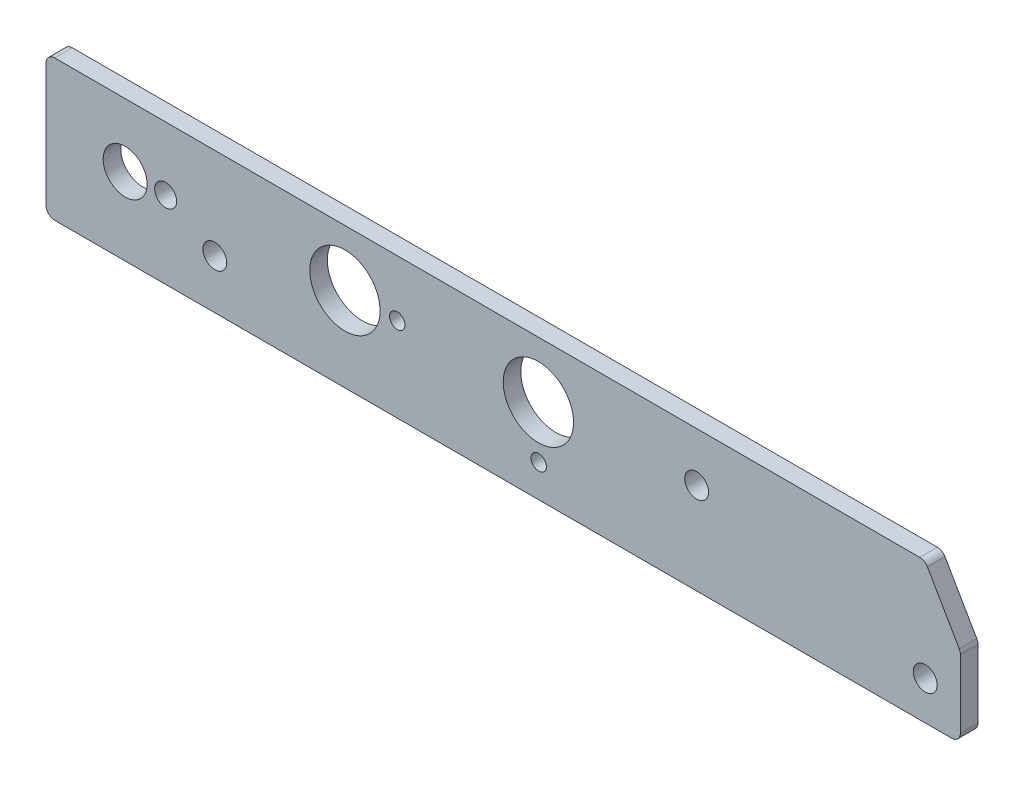
ISO-10303-21;
HEADER;
FILE_DESCRIPTION(('STEP AP214'),'2;1');
FILE_NAME('part.step','',(''),(''),'','','');
FILE_SCHEMA(('AUTOMOTIVE_DESIGN { 1 0 10303 214 1 1 1 1 }'));
ENDSEC;
DATA;
#1=APPLICATION_CONTEXT('core data for automotive mechanical design processes');
#2=APPLICATION_PROTOCOL_DEFINITION('international standard','automotive_design',2000,#1);
#3=PRODUCT_CONTEXT('',#1,'mechanical');
#4=PRODUCT('Part','Part','',(#3));
#5=PRODUCT_RELATED_PRODUCT_CATEGORY('part','',(#4));
#6=PRODUCT_DEFINITION_FORMATION('','',#4);
#7=PRODUCT_DEFINITION_CONTEXT('part definition',#1,'design');
#8=PRODUCT_DEFINITION('design','',#6,#7);
#9=PRODUCT_DEFINITION_SHAPE('','',#8);
#10=(LENGTH_UNIT() NAMED_UNIT(*) SI_UNIT(.MILLI.,.METRE.));
#11=(NAMED_UNIT(*) PLANE_ANGLE_UNIT() SI_UNIT($,.RADIAN.));
#12=(NAMED_UNIT(*) SI_UNIT($,.STERADIAN.) SOLID_ANGLE_UNIT());
#13=UNCERTAINTY_MEASURE_WITH_UNIT(LENGTH_MEASURE(1.E-05),#10,'distance_accuracy_value','');
#14=(GEOMETRIC_REPRESENTATION_CONTEXT(3) GLOBAL_UNCERTAINTY_ASSIGNED_CONTEXT((#13)) GLOBAL_UNIT_ASSIGNED_CONTEXT((#10,
#11,#12)) REPRESENTATION_CONTEXT('',''));
#15=CARTESIAN_POINT('',(0.,0.,0.));
#16=DIRECTION('',(0.,0.,1.));
#17=DIRECTION('',(1.,0.,0.));
#18=AXIS2_PLACEMENT_3D('',#15,#16,#17);
#19=CARTESIAN_POINT('',(157.767651581292,-1.58749999999997,3.175));
#20=DIRECTION('',(0.,0.,1.));
#21=DIRECTION('',(1.,0.,0.));
#22=AXIS2_PLACEMENT_3D('',#19,#20,#21);
#23=PLANE('',#22);
#24=CARTESIAN_POINT('',(158.75,-18.415,3.175));
#25=DIRECTION('',(0.,0.,-1.));
#26=DIRECTION('',(-1.,0.,0.));
#27=AXIS2_PLACEMENT_3D('',#24,#25,#26);
#28=CIRCLE('',#27,2.15265000000001);
#29=CARTESIAN_POINT('',(156.59735,-18.415,3.175));
#30=VERTEX_POINT('',#29);
#31=EDGE_CURVE('E258',#30,#30,#28,.T.);
#32=ORIENTED_EDGE('',*,*,#31,.T.);
#33=EDGE_LOOP('',(#32));
#34=FACE_BOUND('',#33,.T.);
#35=CARTESIAN_POINT('',(117.475,-8.88999999999997,3.175));
#36=DIRECTION('',(0.,0.,-1.));
#37=DIRECTION('',(-1.,0.,0.));
#38=AXIS2_PLACEMENT_3D('',#35,#36,#37);
#39=CIRCLE('',#38,2.15265000000001);
#40=CARTESIAN_POINT('',(115.32235,-8.88999999999997,3.175));
#41=VERTEX_POINT('',#40);
#42=EDGE_CURVE('E252',#41,#41,#39,.T.);
#43=ORIENTED_EDGE('',*,*,#42,.T.);
#44=EDGE_LOOP('',(#43));
#45=FACE_BOUND('',#44,.T.);
#46=CARTESIAN_POINT('',(30.48,-16.51,3.175));
#47=DIRECTION('',(0.,0.,-1.));
#48=DIRECTION('',(-1.,0.,0.));
#49=AXIS2_PLACEMENT_3D('',#46,#47,#48);
#50=CIRCLE('',#49,2.15265);
#51=CARTESIAN_POINT('',(28.32735,-16.51,3.175));
#52=VERTEX_POINT('',#51);
#53=EDGE_CURVE('E246',#52,#52,#50,.T.);
#54=ORIENTED_EDGE('',*,*,#53,.T.);
#55=EDGE_LOOP('',(#54));
#56=FACE_BOUND('',#55,.T.);
#57=CARTESIAN_POINT('',(88.9594715975967,-19.537541196517,3.175));
#58=DIRECTION('',(0.,0.,-1.));
#59=DIRECTION('',(-1.,0.,0.));
#60=AXIS2_PLACEMENT_3D('',#57,#58,#59);
#61=CIRCLE('',#60,1.389126);
#62=CARTESIAN_POINT('',(87.5703455975967,-19.537541196517,3.175));
#63=VERTEX_POINT('',#62);
#64=EDGE_CURVE('E240',#63,#63,#61,.T.);
#65=ORIENTED_EDGE('',*,*,#64,.T.);
#66=EDGE_LOOP('',(#65));
#67=FACE_BOUND('',#66,.T.);
#68=CARTESIAN_POINT('',(63.423407806558,-10.1599999999991,3.175));
#69=DIRECTION('',(0.,0.,-1.));
#70=DIRECTION('',(-1.,0.,0.));
#71=AXIS2_PLACEMENT_3D('',#68,#69,#70);
#72=CIRCLE('',#71,1.389126);
#73=CARTESIAN_POINT('',(62.034281806558,-10.1599999999991,3.175));
#74=VERTEX_POINT('',#73);
#75=EDGE_CURVE('E234',#74,#74,#72,.T.);
#76=ORIENTED_EDGE('',*,*,#75,.T.);
#77=EDGE_LOOP('',(#76));
#78=FACE_BOUND('',#77,.T.);
#79=CARTESIAN_POINT('',(21.598282461873,-11.4299999999998,3.175));
#80=DIRECTION('',(0.,0.,-1.));
#81=DIRECTION('',(-1.,0.,0.));
#82=AXIS2_PLACEMENT_3D('',#79,#80,#81);
#83=CIRCLE('',#82,1.984375);
#84=CARTESIAN_POINT('',(19.613907461873,-11.4299999999998,3.175));
#85=VERTEX_POINT('',#84);
#86=EDGE_CURVE('E228',#85,#85,#83,.T.);
#87=ORIENTED_EDGE('',*,*,#86,.T.);
#88=EDGE_LOOP('',(#87));
#89=FACE_BOUND('',#88,.T.);
#90=CARTESIAN_POINT('',(14.2875000000084,-11.4300000000016,3.175));
#91=DIRECTION('',(0.,0.,-1.));
#92=DIRECTION('',(-1.,0.,0.));
#93=AXIS2_PLACEMENT_3D('',#90,#91,#92);
#94=CIRCLE('',#93,3.96875);
#95=CARTESIAN_POINT('',(10.3187500000084,-11.4300000000016,3.175));
#96=VERTEX_POINT('',#95);
#97=EDGE_CURVE('E222',#96,#96,#94,.T.);
#98=ORIENTED_EDGE('',*,*,#97,.T.);
#99=EDGE_LOOP('',(#98));
#100=FACE_BOUND('',#99,.T.);
#101=CARTESIAN_POINT('',(53.9750000000004,-10.1599999999995,3.175));
#102=DIRECTION('',(0.,0.,-1.));
#103=DIRECTION('',(-1.,0.,0.));
#104=AXIS2_PLACEMENT_3D('',#101,#102,#103);
#105=CIRCLE('',#104,6.35);
#106=CARTESIAN_POINT('',(47.6250000000004,-10.1599999999995,3.175));
#107=VERTEX_POINT('',#106);
#108=EDGE_CURVE('E216',#107,#107,#105,.T.);
#109=ORIENTED_EDGE('',*,*,#108,.T.);
#110=EDGE_LOOP('',(#109));
#111=FACE_BOUND('',#110,.T.);
#112=CARTESIAN_POINT('',(157.767651581292,-1.58749999999997,3.175));
#113=DIRECTION('',(0.,0.,1.));
#114=DIRECTION('',(1.,0.,0.));
#115=AXIS2_PLACEMENT_3D('',#112,#113,#114);
#116=CIRCLE('',#115,1.58749999999995);
#117=CARTESIAN_POINT('',(159.1424669098,-0.793749999999943,3.175));
#118=VERTEX_POINT('',#117);
#119=CARTESIAN_POINT('',(157.767651581292,0.,3.175));
#120=VERTEX_POINT('',#119);
#121=EDGE_CURVE('E164',#118,#120,#116,.T.);
#122=ORIENTED_EDGE('',*,*,#121,.T.);
#123=DIRECTION('',(-1.,0.,0.));
#124=VECTOR('',#123,1.);
#125=CARTESIAN_POINT('',(157.767651581292,0.,3.175));
#126=LINE('',#125,#124);
#127=CARTESIAN_POINT('',(1.5875,0.,3.175));
#128=VERTEX_POINT('',#127);
#129=EDGE_CURVE('E102',#120,#128,#126,.T.);
#130=ORIENTED_EDGE('',*,*,#129,.T.);
#131=CARTESIAN_POINT('',(1.5875,-1.5875,3.175));
#132=DIRECTION('',(0.,0.,1.));
#133=DIRECTION('',(1.,0.,0.));
#134=AXIS2_PLACEMENT_3D('',#131,#132,#133);
#135=CIRCLE('',#134,1.58750000000001);
#136=CARTESIAN_POINT('',(0.,-1.5875,3.175));
#137=VERTEX_POINT('',#136);
#138=EDGE_CURVE('E185',#128,#137,#135,.T.);
#139=ORIENTED_EDGE('',*,*,#138,.T.);
#140=DIRECTION('',(0.,-1.,0.));
#141=VECTOR('',#140,1.);
#142=CARTESIAN_POINT('',(0.,-1.5875,3.175));
#143=LINE('',#142,#141);
#144=CARTESIAN_POINT('',(0.,-23.8125,3.175));
#145=VERTEX_POINT('',#144);
#146=EDGE_CURVE('E203',#137,#145,#143,.T.);
#147=ORIENTED_EDGE('',*,*,#146,.T.);
#148=CARTESIAN_POINT('',(1.58749999999999,-23.8125,3.175));
#149=DIRECTION('',(0.,0.,1.));
#150=DIRECTION('',(1.,0.,0.));
#151=AXIS2_PLACEMENT_3D('',#148,#149,#150);
#152=CIRCLE('',#151,1.58749999999999);
#153=CARTESIAN_POINT('',(1.58749999999999,-25.4,3.175));
#154=VERTEX_POINT('',#153);
#155=EDGE_CURVE('E200',#145,#154,#152,.T.);
#156=ORIENTED_EDGE('',*,*,#155,.T.);
#157=DIRECTION('',(1.,0.,0.));
#158=VECTOR('',#157,1.);
#159=CARTESIAN_POINT('',(1.58749999999999,-25.4,3.175));
#160=LINE('',#159,#158);
#161=CARTESIAN_POINT('',(163.5125,-25.4,3.175));
#162=VERTEX_POINT('',#161);
#163=EDGE_CURVE('E202',#154,#162,#160,.T.);
#164=ORIENTED_EDGE('',*,*,#163,.T.);
#165=CARTESIAN_POINT('',(163.5125,-23.8125,3.175));
#166=DIRECTION('',(0.,0.,1.));
#167=DIRECTION('',(1.,0.,0.));
#168=AXIS2_PLACEMENT_3D('',#165,#166,#167);
#169=CIRCLE('',#168,1.58749999999998);
#170=CARTESIAN_POINT('',(165.1,-23.8125,3.175));
#171=VERTEX_POINT('',#170);
#172=EDGE_CURVE('E127',#162,#171,#169,.T.);
#173=ORIENTED_EDGE('',*,*,#172,.T.);
#174=DIRECTION('',(0.,1.,0.));
#175=VECTOR('',#174,1.);
#176=CARTESIAN_POINT('',(165.1,-23.8125,3.175));
#177=LINE('',#176,#175);
#178=CARTESIAN_POINT('',(165.1,-11.5378693429844,3.175));
#179=VERTEX_POINT('',#178);
#180=EDGE_CURVE('E121',#171,#179,#177,.T.);
#181=ORIENTED_EDGE('',*,*,#180,.T.);
#182=CARTESIAN_POINT('',(163.5125,-11.5378693429844,3.175));
#183=DIRECTION('',(0.,0.,1.));
#184=DIRECTION('',(1.,0.,0.));
#185=AXIS2_PLACEMENT_3D('',#182,#183,#184);
#186=CIRCLE('',#185,1.5875);
#187=CARTESIAN_POINT('',(164.887315328508,-10.7441193429844,3.175));
#188=VERTEX_POINT('',#187);
#189=EDGE_CURVE('E125',#179,#188,#186,.T.);
#190=ORIENTED_EDGE('',*,*,#189,.T.);
#191=DIRECTION('',(-0.5,0.866025403784439,0.));
#192=VECTOR('',#191,1.);
#193=CARTESIAN_POINT('',(164.887315328508,-10.7441193429844,3.175));
#194=LINE('',#193,#192);
#195=EDGE_CURVE('E53',#188,#118,#194,.T.);
#196=ORIENTED_EDGE('',*,*,#195,.T.);
#197=EDGE_LOOP('',(#122,#130,#139,#147,#156,#164,#173,#181,#190,#196));
#198=FACE_BOUND('',#197,.T.);
#199=CARTESIAN_POINT('',(88.9000000000094,-10.1600000000004,3.175));
#200=DIRECTION('',(0.,0.,-1.));
#201=DIRECTION('',(-1.,0.,0.));
#202=AXIS2_PLACEMENT_3D('',#199,#200,#201);
#203=CIRCLE('',#202,6.34999999999999);
#204=CARTESIAN_POINT('',(82.5500000000094,-10.1600000000004,3.175));
#205=VERTEX_POINT('',#204);
#206=EDGE_CURVE('E149',#205,#205,#203,.T.);
#207=ORIENTED_EDGE('',*,*,#206,.T.);
#208=EDGE_LOOP('',(#207));
#209=FACE_BOUND('',#208,.T.);
#210=ADVANCED_FACE('F36',(#34,#45,#56,#67,#78,#89,#100,#111,#198,#209),#23,.T.);
#211=CARTESIAN_POINT('',(157.767651581292,-1.58749999999997,3.175));
#212=DIRECTION('',(0.,0.,-1.));
#213=DIRECTION('',(-1.,0.,0.));
#214=AXIS2_PLACEMENT_3D('',#211,#212,#213);
#215=CYLINDRICAL_SURFACE('',#214,1.58749999999995);
#216=CARTESIAN_POINT('',(157.767651581292,-1.58749999999997,0.));
#217=DIRECTION('',(0.,0.,1.));
#218=DIRECTION('',(1.,0.,0.));
#219=AXIS2_PLACEMENT_3D('',#216,#217,#218);
#220=CIRCLE('',#219,1.58749999999995);
#221=CARTESIAN_POINT('',(159.1424669098,-0.793749999999943,0.));
#222=VERTEX_POINT('',#221);
#223=CARTESIAN_POINT('',(157.767651581292,0.,0.));
#224=VERTEX_POINT('',#223);
#225=EDGE_CURVE('E145',#222,#224,#220,.T.);
#226=ORIENTED_EDGE('',*,*,#225,.T.);
#227=DIRECTION('',(0.,0.,-1.));
#228=VECTOR('',#227,1.);
#229=CARTESIAN_POINT('',(157.767651581292,0.,3.175));
#230=LINE('',#229,#228);
#231=EDGE_CURVE('E11',#120,#224,#230,.T.);
#232=ORIENTED_EDGE('',*,*,#231,.F.);
#233=ORIENTED_EDGE('',*,*,#121,.F.);
#234=DIRECTION('',(0.,0.,-1.));
#235=VECTOR('',#234,1.);
#236=CARTESIAN_POINT('',(159.1424669098,-0.793749999999943,3.175));
#237=LINE('',#236,#235);
#238=EDGE_CURVE('E141',#118,#222,#237,.T.);
#239=ORIENTED_EDGE('',*,*,#238,.T.);
#240=EDGE_LOOP('',(#226,#232,#233,#239));
#241=FACE_BOUND('',#240,.T.);
#242=ADVANCED_FACE('F38',(#241),#215,.T.);
#243=CARTESIAN_POINT('',(157.767651581292,0.,3.175));
#244=DIRECTION('',(0.,-1.,0.));
#245=DIRECTION('',(1.,0.,0.));
#246=AXIS2_PLACEMENT_3D('',#243,#244,#245);
#247=PLANE('',#246);
#248=DIRECTION('',(-1.,0.,0.));
#249=VECTOR('',#248,1.);
#250=CARTESIAN_POINT('',(157.767651581292,0.,0.));
#251=LINE('',#250,#249);
#252=CARTESIAN_POINT('',(1.5875,0.,0.));
#253=VERTEX_POINT('',#252);
#254=EDGE_CURVE('E148',#224,#253,#251,.T.);
#255=ORIENTED_EDGE('',*,*,#254,.T.);
#256=DIRECTION('',(0.,0.,-1.));
#257=VECTOR('',#256,1.);
#258=CARTESIAN_POINT('',(1.5875,0.,3.175));
#259=LINE('',#258,#257);
#260=EDGE_CURVE('E45',#128,#253,#259,.T.);
#261=ORIENTED_EDGE('',*,*,#260,.F.);
#262=ORIENTED_EDGE('',*,*,#129,.F.);
#263=ORIENTED_EDGE('',*,*,#231,.T.);
#264=EDGE_LOOP('',(#255,#261,#262,#263));
#265=FACE_BOUND('',#264,.T.);
#266=ADVANCED_FACE('F305',(#265),#247,.F.);
#267=CARTESIAN_POINT('',(1.5875,-1.5875,3.175));
#268=DIRECTION('',(0.,0.,-1.));
#269=DIRECTION('',(-1.,0.,0.));
#270=AXIS2_PLACEMENT_3D('',#267,#268,#269);
#271=CYLINDRICAL_SURFACE('',#270,1.58750000000001);
#272=CARTESIAN_POINT('',(1.5875,-1.5875,0.));
#273=DIRECTION('',(0.,0.,1.));
#274=DIRECTION('',(1.,0.,0.));
#275=AXIS2_PLACEMENT_3D('',#272,#273,#274);
#276=CIRCLE('',#275,1.58750000000001);
#277=CARTESIAN_POINT('',(0.,-1.5875,0.));
#278=VERTEX_POINT('',#277);
#279=EDGE_CURVE('E151',#253,#278,#276,.T.);
#280=ORIENTED_EDGE('',*,*,#279,.T.);
#281=DIRECTION('',(0.,0.,-1.));
#282=VECTOR('',#281,1.);
#283=CARTESIAN_POINT('',(0.,-1.5875,3.175));
#284=LINE('',#283,#282);
#285=EDGE_CURVE('E177',#137,#278,#284,.T.);
#286=ORIENTED_EDGE('',*,*,#285,.F.);
#287=ORIENTED_EDGE('',*,*,#138,.F.);
#288=ORIENTED_EDGE('',*,*,#260,.T.);
#289=EDGE_LOOP('',(#280,#286,#287,#288));
#290=FACE_BOUND('',#289,.T.);
#291=ADVANCED_FACE('F183',(#290),#271,.T.);
#292=CARTESIAN_POINT('',(0.,-1.5875,3.175));
#293=DIRECTION('',(1.,0.,0.));
#294=DIRECTION('',(0.,1.,0.));
#295=AXIS2_PLACEMENT_3D('',#292,#293,#294);
#296=PLANE('',#295);
#297=DIRECTION('',(0.,-1.,0.));
#298=VECTOR('',#297,1.);
#299=CARTESIAN_POINT('',(0.,-1.5875,0.));
#300=LINE('',#299,#298);
#301=CARTESIAN_POINT('',(0.,-23.8125,0.));
#302=VERTEX_POINT('',#301);
#303=EDGE_CURVE('E153',#278,#302,#300,.T.);
#304=ORIENTED_EDGE('',*,*,#303,.T.);
#305=DIRECTION('',(0.,0.,-1.));
#306=VECTOR('',#305,1.);
#307=CARTESIAN_POINT('',(0.,-23.8125,3.175));
#308=LINE('',#307,#306);
#309=EDGE_CURVE('E174',#145,#302,#308,.T.);
#310=ORIENTED_EDGE('',*,*,#309,.F.);
#311=ORIENTED_EDGE('',*,*,#146,.F.);
#312=ORIENTED_EDGE('',*,*,#285,.T.);
#313=EDGE_LOOP('',(#304,#310,#311,#312));
#314=FACE_BOUND('',#313,.T.);
#315=ADVANCED_FACE('F194',(#314),#296,.F.);
#316=CARTESIAN_POINT('',(1.58749999999999,-23.8125,3.175));
#317=DIRECTION('',(0.,0.,-1.));
#318=DIRECTION('',(-1.,0.,0.));
#319=AXIS2_PLACEMENT_3D('',#316,#317,#318);
#320=CYLINDRICAL_SURFACE('',#319,1.58749999999999);
#321=CARTESIAN_POINT('',(1.58749999999999,-23.8125,0.));
#322=DIRECTION('',(0.,0.,1.));
#323=DIRECTION('',(1.,0.,0.));
#324=AXIS2_PLACEMENT_3D('',#321,#322,#323);
#325=CIRCLE('',#324,1.58749999999999);
#326=CARTESIAN_POINT('',(1.58749999999999,-25.4,0.));
#327=VERTEX_POINT('',#326);
#328=EDGE_CURVE('E155',#302,#327,#325,.T.);
#329=ORIENTED_EDGE('',*,*,#328,.T.);
#330=DIRECTION('',(0.,0.,-1.));
#331=VECTOR('',#330,1.);
#332=CARTESIAN_POINT('',(1.58749999999999,-25.4,3.175));
#333=LINE('',#332,#331);
#334=EDGE_CURVE('E171',#154,#327,#333,.T.);
#335=ORIENTED_EDGE('',*,*,#334,.F.);
#336=ORIENTED_EDGE('',*,*,#155,.F.);
#337=ORIENTED_EDGE('',*,*,#309,.T.);
#338=EDGE_LOOP('',(#329,#335,#336,#337));
#339=FACE_BOUND('',#338,.T.);
#340=ADVANCED_FACE('F198',(#339),#320,.T.);
#341=CARTESIAN_POINT('',(1.58749999999999,-25.4,3.175));
#342=DIRECTION('',(0.,1.,0.));
#343=DIRECTION('',(-1.,0.,0.));
#344=AXIS2_PLACEMENT_3D('',#341,#342,#343);
#345=PLANE('',#344);
#346=DIRECTION('',(1.,0.,0.));
#347=VECTOR('',#346,1.);
#348=CARTESIAN_POINT('',(1.58749999999999,-25.4,0.));
#349=LINE('',#348,#347);
#350=CARTESIAN_POINT('',(163.5125,-25.4,0.));
#351=VERTEX_POINT('',#350);
#352=EDGE_CURVE('E157',#327,#351,#349,.T.);
#353=ORIENTED_EDGE('',*,*,#352,.T.);
#354=DIRECTION('',(0.,0.,-1.));
#355=VECTOR('',#354,1.);
#356=CARTESIAN_POINT('',(163.5125,-25.4,3.175));
#357=LINE('',#356,#355);
#358=EDGE_CURVE('E168',#162,#351,#357,.T.);
#359=ORIENTED_EDGE('',*,*,#358,.F.);
#360=ORIENTED_EDGE('',*,*,#163,.F.);
#361=ORIENTED_EDGE('',*,*,#334,.T.);
#362=EDGE_LOOP('',(#353,#359,#360,#361));
#363=FACE_BOUND('',#362,.T.);
#364=ADVANCED_FACE('F318',(#363),#345,.F.);
#365=CARTESIAN_POINT('',(163.5125,-23.8125,3.175));
#366=DIRECTION('',(0.,0.,-1.));
#367=DIRECTION('',(-1.,0.,0.));
#368=AXIS2_PLACEMENT_3D('',#365,#366,#367);
#369=CYLINDRICAL_SURFACE('',#368,1.58749999999998);
#370=CARTESIAN_POINT('',(163.5125,-23.8125,0.));
#371=DIRECTION('',(0.,0.,1.));
#372=DIRECTION('',(1.,0.,0.));
#373=AXIS2_PLACEMENT_3D('',#370,#371,#372);
#374=CIRCLE('',#373,1.58749999999998);
#375=CARTESIAN_POINT('',(165.1,-23.8125,0.));
#376=VERTEX_POINT('',#375);
#377=EDGE_CURVE('E159',#351,#376,#374,.T.);
#378=ORIENTED_EDGE('',*,*,#377,.T.);
#379=DIRECTION('',(0.,0.,-1.));
#380=VECTOR('',#379,1.);
#381=CARTESIAN_POINT('',(165.1,-23.8125,3.175));
#382=LINE('',#381,#380);
#383=EDGE_CURVE('E136',#171,#376,#382,.T.);
#384=ORIENTED_EDGE('',*,*,#383,.F.);
#385=ORIENTED_EDGE('',*,*,#172,.F.);
#386=ORIENTED_EDGE('',*,*,#358,.T.);
#387=EDGE_LOOP('',(#378,#384,#385,#386));
#388=FACE_BOUND('',#387,.T.);
#389=ADVANCED_FACE('F315',(#388),#369,.T.);
#390=CARTESIAN_POINT('',(165.1,-23.8125,3.175));
#391=DIRECTION('',(-1.,0.,0.));
#392=DIRECTION('',(0.,0.,1.));
#393=AXIS2_PLACEMENT_3D('',#390,#391,#392);
#394=PLANE('',#393);
#395=DIRECTION('',(0.,1.,0.));
#396=VECTOR('',#395,1.);
#397=CARTESIAN_POINT('',(165.1,-23.8125,0.));
#398=LINE('',#397,#396);
#399=CARTESIAN_POINT('',(165.1,-11.5378693429844,0.));
#400=VERTEX_POINT('',#399);
#401=EDGE_CURVE('E135',#376,#400,#398,.T.);
#402=ORIENTED_EDGE('',*,*,#401,.T.);
#403=DIRECTION('',(0.,0.,-1.));
#404=VECTOR('',#403,1.);
#405=CARTESIAN_POINT('',(165.1,-11.5378693429844,3.175));
#406=LINE('',#405,#404);
#407=EDGE_CURVE('E132',#179,#400,#406,.T.);
#408=ORIENTED_EDGE('',*,*,#407,.F.);
#409=ORIENTED_EDGE('',*,*,#180,.F.);
#410=ORIENTED_EDGE('',*,*,#383,.T.);
#411=EDGE_LOOP('',(#402,#408,#409,#410));
#412=FACE_BOUND('',#411,.T.);
#413=ADVANCED_FACE('F133',(#412),#394,.F.);
#414=CARTESIAN_POINT('',(163.5125,-11.5378693429844,3.175));
#415=DIRECTION('',(0.,0.,-1.));
#416=DIRECTION('',(-1.,0.,0.));
#417=AXIS2_PLACEMENT_3D('',#414,#415,#416);
#418=CYLINDRICAL_SURFACE('',#417,1.5875);
#419=CARTESIAN_POINT('',(163.5125,-11.5378693429844,0.));
#420=DIRECTION('',(0.,0.,1.));
#421=DIRECTION('',(1.,0.,0.));
#422=AXIS2_PLACEMENT_3D('',#419,#420,#421);
#423=CIRCLE('',#422,1.5875);
#424=CARTESIAN_POINT('',(164.887315328508,-10.7441193429844,0.));
#425=VERTEX_POINT('',#424);
#426=EDGE_CURVE('E88',#400,#425,#423,.T.);
#427=ORIENTED_EDGE('',*,*,#426,.T.);
#428=DIRECTION('',(0.,0.,-1.));
#429=VECTOR('',#428,1.);
#430=CARTESIAN_POINT('',(164.887315328508,-10.7441193429844,3.175));
#431=LINE('',#430,#429);
#432=EDGE_CURVE('E137',#188,#425,#431,.T.);
#433=ORIENTED_EDGE('',*,*,#432,.F.);
#434=ORIENTED_EDGE('',*,*,#189,.F.);
#435=ORIENTED_EDGE('',*,*,#407,.T.);
#436=EDGE_LOOP('',(#427,#433,#434,#435));
#437=FACE_BOUND('',#436,.T.);
#438=ADVANCED_FACE('F139',(#437),#418,.T.);
#439=CARTESIAN_POINT('',(164.887315328508,-10.7441193429844,3.175));
#440=DIRECTION('',(-0.866025403784439,-0.5,0.));
#441=DIRECTION('',(0.5,-0.866025403784439,0.));
#442=AXIS2_PLACEMENT_3D('',#439,#440,#441);
#443=PLANE('',#442);
#444=DIRECTION('',(-0.5,0.866025403784439,0.));
#445=VECTOR('',#444,1.);
#446=CARTESIAN_POINT('',(164.887315328508,-10.7441193429844,0.));
#447=LINE('',#446,#445);
#448=EDGE_CURVE('E94',#425,#222,#447,.T.);
#449=ORIENTED_EDGE('',*,*,#448,.T.);
#450=ORIENTED_EDGE('',*,*,#238,.F.);
#451=ORIENTED_EDGE('',*,*,#195,.F.);
#452=ORIENTED_EDGE('',*,*,#432,.T.);
#453=EDGE_LOOP('',(#449,#450,#451,#452));
#454=FACE_BOUND('',#453,.T.);
#455=ADVANCED_FACE('F270',(#454),#443,.F.);
#456=CARTESIAN_POINT('',(157.767651581292,-1.58749999999997,0.));
#457=DIRECTION('',(0.,0.,1.));
#458=DIRECTION('',(1.,0.,0.));
#459=AXIS2_PLACEMENT_3D('',#456,#457,#458);
#460=PLANE('',#459);
#461=CARTESIAN_POINT('',(158.75,-18.415,0.));
#462=DIRECTION('',(0.,0.,-1.));
#463=DIRECTION('',(-1.,0.,0.));
#464=AXIS2_PLACEMENT_3D('',#461,#462,#463);
#465=CIRCLE('',#464,2.15265000000001);
#466=CARTESIAN_POINT('',(156.59735,-18.415,0.));
#467=VERTEX_POINT('',#466);
#468=EDGE_CURVE('E261',#467,#467,#465,.T.);
#469=ORIENTED_EDGE('',*,*,#468,.F.);
#470=EDGE_LOOP('',(#469));
#471=FACE_BOUND('',#470,.T.);
#472=CARTESIAN_POINT('',(117.475,-8.88999999999997,0.));
#473=DIRECTION('',(0.,0.,-1.));
#474=DIRECTION('',(-1.,0.,0.));
#475=AXIS2_PLACEMENT_3D('',#472,#473,#474);
#476=CIRCLE('',#475,2.15265000000001);
#477=CARTESIAN_POINT('',(115.32235,-8.88999999999997,0.));
#478=VERTEX_POINT('',#477);
#479=EDGE_CURVE('E255',#478,#478,#476,.T.);
#480=ORIENTED_EDGE('',*,*,#479,.F.);
#481=EDGE_LOOP('',(#480));
#482=FACE_BOUND('',#481,.T.);
#483=CARTESIAN_POINT('',(30.48,-16.51,0.));
#484=DIRECTION('',(0.,0.,-1.));
#485=DIRECTION('',(-1.,0.,0.));
#486=AXIS2_PLACEMENT_3D('',#483,#484,#485);
#487=CIRCLE('',#486,2.15265);
#488=CARTESIAN_POINT('',(28.32735,-16.51,0.));
#489=VERTEX_POINT('',#488);
#490=EDGE_CURVE('E249',#489,#489,#487,.T.);
#491=ORIENTED_EDGE('',*,*,#490,.F.);
#492=EDGE_LOOP('',(#491));
#493=FACE_BOUND('',#492,.T.);
#494=CARTESIAN_POINT('',(88.9594715975967,-19.537541196517,0.));
#495=DIRECTION('',(0.,0.,-1.));
#496=DIRECTION('',(-1.,0.,0.));
#497=AXIS2_PLACEMENT_3D('',#494,#495,#496);
#498=CIRCLE('',#497,1.389126);
#499=CARTESIAN_POINT('',(87.5703455975967,-19.537541196517,0.));
#500=VERTEX_POINT('',#499);
#501=EDGE_CURVE('E243',#500,#500,#498,.T.);
#502=ORIENTED_EDGE('',*,*,#501,.F.);
#503=EDGE_LOOP('',(#502));
#504=FACE_BOUND('',#503,.T.);
#505=CARTESIAN_POINT('',(63.423407806558,-10.1599999999991,0.));
#506=DIRECTION('',(0.,0.,-1.));
#507=DIRECTION('',(-1.,0.,0.));
#508=AXIS2_PLACEMENT_3D('',#505,#506,#507);
#509=CIRCLE('',#508,1.389126);
#510=CARTESIAN_POINT('',(62.034281806558,-10.1599999999991,0.));
#511=VERTEX_POINT('',#510);
#512=EDGE_CURVE('E237',#511,#511,#509,.T.);
#513=ORIENTED_EDGE('',*,*,#512,.F.);
#514=EDGE_LOOP('',(#513));
#515=FACE_BOUND('',#514,.T.);
#516=CARTESIAN_POINT('',(21.598282461873,-11.4299999999998,0.));
#517=DIRECTION('',(0.,0.,-1.));
#518=DIRECTION('',(-1.,0.,0.));
#519=AXIS2_PLACEMENT_3D('',#516,#517,#518);
#520=CIRCLE('',#519,1.984375);
#521=CARTESIAN_POINT('',(19.613907461873,-11.4299999999998,0.));
#522=VERTEX_POINT('',#521);
#523=EDGE_CURVE('E231',#522,#522,#520,.T.);
#524=ORIENTED_EDGE('',*,*,#523,.F.);
#525=EDGE_LOOP('',(#524));
#526=FACE_BOUND('',#525,.T.);
#527=CARTESIAN_POINT('',(14.2875000000084,-11.4300000000016,0.));
#528=DIRECTION('',(0.,0.,-1.));
#529=DIRECTION('',(-1.,0.,0.));
#530=AXIS2_PLACEMENT_3D('',#527,#528,#529);
#531=CIRCLE('',#530,3.96875);
#532=CARTESIAN_POINT('',(10.3187500000084,-11.4300000000016,0.));
#533=VERTEX_POINT('',#532);
#534=EDGE_CURVE('E225',#533,#533,#531,.T.);
#535=ORIENTED_EDGE('',*,*,#534,.F.);
#536=EDGE_LOOP('',(#535));
#537=FACE_BOUND('',#536,.T.);
#538=CARTESIAN_POINT('',(53.9750000000004,-10.1599999999995,0.));
#539=DIRECTION('',(0.,0.,-1.));
#540=DIRECTION('',(-1.,0.,0.));
#541=AXIS2_PLACEMENT_3D('',#538,#539,#540);
#542=CIRCLE('',#541,6.35);
#543=CARTESIAN_POINT('',(47.6250000000004,-10.1599999999995,0.));
#544=VERTEX_POINT('',#543);
#545=EDGE_CURVE('E219',#544,#544,#542,.T.);
#546=ORIENTED_EDGE('',*,*,#545,.F.);
#547=EDGE_LOOP('',(#546));
#548=FACE_BOUND('',#547,.T.);
#549=CARTESIAN_POINT('',(88.9000000000094,-10.1600000000004,0.));
#550=DIRECTION('',(0.,0.,-1.));
#551=DIRECTION('',(-1.,0.,0.));
#552=AXIS2_PLACEMENT_3D('',#549,#550,#551);
#553=CIRCLE('',#552,6.34999999999999);
#554=CARTESIAN_POINT('',(82.5500000000094,-10.1600000000004,0.));
#555=VERTEX_POINT('',#554);
#556=EDGE_CURVE('E213',#555,#555,#553,.T.);
#557=ORIENTED_EDGE('',*,*,#556,.F.);
#558=EDGE_LOOP('',(#557));
#559=FACE_BOUND('',#558,.T.);
#560=ORIENTED_EDGE('',*,*,#225,.F.);
#561=ORIENTED_EDGE('',*,*,#448,.F.);
#562=ORIENTED_EDGE('',*,*,#426,.F.);
#563=ORIENTED_EDGE('',*,*,#401,.F.);
#564=ORIENTED_EDGE('',*,*,#377,.F.);
#565=ORIENTED_EDGE('',*,*,#352,.F.);
#566=ORIENTED_EDGE('',*,*,#328,.F.);
#567=ORIENTED_EDGE('',*,*,#303,.F.);
#568=ORIENTED_EDGE('',*,*,#279,.F.);
#569=ORIENTED_EDGE('',*,*,#254,.F.);
#570=EDGE_LOOP('',(#560,#561,#562,#563,#564,#565,#566,#567,#568,#569));
#571=FACE_BOUND('',#570,.T.);
#572=ADVANCED_FACE('F189',(#471,#482,#493,#504,#515,#526,#537,#548,#559,#571),#460,.F.);
#573=CARTESIAN_POINT('',(88.9000000000094,-10.1600000000004,0.));
#574=DIRECTION('',(0.,0.,-1.));
#575=DIRECTION('',(-1.,0.,0.));
#576=AXIS2_PLACEMENT_3D('',#573,#574,#575);
#577=CYLINDRICAL_SURFACE('',#576,6.34999999999999);
#578=ORIENTED_EDGE('',*,*,#206,.F.);
#579=EDGE_LOOP('',(#578));
#580=FACE_BOUND('',#579,.T.);
#581=ORIENTED_EDGE('',*,*,#556,.T.);
#582=EDGE_LOOP('',(#581));
#583=FACE_BOUND('',#582,.T.);
#584=ADVANCED_FACE('F269',(#580,#583),#577,.F.);
#585=CARTESIAN_POINT('',(53.9750000000004,-10.1599999999995,0.));
#586=DIRECTION('',(0.,0.,-1.));
#587=DIRECTION('',(-1.,0.,0.));
#588=AXIS2_PLACEMENT_3D('',#585,#586,#587);
#589=CYLINDRICAL_SURFACE('',#588,6.35);
#590=ORIENTED_EDGE('',*,*,#108,.F.);
#591=EDGE_LOOP('',(#590));
#592=FACE_BOUND('',#591,.T.);
#593=ORIENTED_EDGE('',*,*,#545,.T.);
#594=EDGE_LOOP('',(#593));
#595=FACE_BOUND('',#594,.T.);
#596=ADVANCED_FACE('F289',(#592,#595),#589,.F.);
#597=CARTESIAN_POINT('',(14.2875000000084,-11.4300000000016,0.));
#598=DIRECTION('',(0.,0.,-1.));
#599=DIRECTION('',(-1.,0.,0.));
#600=AXIS2_PLACEMENT_3D('',#597,#598,#599);
#601=CYLINDRICAL_SURFACE('',#600,3.96875);
#602=ORIENTED_EDGE('',*,*,#97,.F.);
#603=EDGE_LOOP('',(#602));
#604=FACE_BOUND('',#603,.T.);
#605=ORIENTED_EDGE('',*,*,#534,.T.);
#606=EDGE_LOOP('',(#605));
#607=FACE_BOUND('',#606,.T.);
#608=ADVANCED_FACE('F295',(#604,#607),#601,.F.);
#609=CARTESIAN_POINT('',(21.598282461873,-11.4299999999998,0.));
#610=DIRECTION('',(0.,0.,-1.));
#611=DIRECTION('',(-1.,0.,0.));
#612=AXIS2_PLACEMENT_3D('',#609,#610,#611);
#613=CYLINDRICAL_SURFACE('',#612,1.984375);
#614=ORIENTED_EDGE('',*,*,#86,.F.);
#615=EDGE_LOOP('',(#614));
#616=FACE_BOUND('',#615,.T.);
#617=ORIENTED_EDGE('',*,*,#523,.T.);
#618=EDGE_LOOP('',(#617));
#619=FACE_BOUND('',#618,.T.);
#620=ADVANCED_FACE('F419',(#616,#619),#613,.F.);
#621=CARTESIAN_POINT('',(63.423407806558,-10.1599999999991,0.));
#622=DIRECTION('',(0.,0.,-1.));
#623=DIRECTION('',(-1.,0.,0.));
#624=AXIS2_PLACEMENT_3D('',#621,#622,#623);
#625=CYLINDRICAL_SURFACE('',#624,1.389126);
#626=ORIENTED_EDGE('',*,*,#75,.F.);
#627=EDGE_LOOP('',(#626));
#628=FACE_BOUND('',#627,.T.);
#629=ORIENTED_EDGE('',*,*,#512,.T.);
#630=EDGE_LOOP('',(#629));
#631=FACE_BOUND('',#630,.T.);
#632=ADVANCED_FACE('F415',(#628,#631),#625,.F.);
#633=CARTESIAN_POINT('',(88.9594715975967,-19.537541196517,0.));
#634=DIRECTION('',(0.,0.,-1.));
#635=DIRECTION('',(-1.,0.,0.));
#636=AXIS2_PLACEMENT_3D('',#633,#634,#635);
#637=CYLINDRICAL_SURFACE('',#636,1.389126);
#638=ORIENTED_EDGE('',*,*,#64,.F.);
#639=EDGE_LOOP('',(#638));
#640=FACE_BOUND('',#639,.T.);
#641=ORIENTED_EDGE('',*,*,#501,.T.);
#642=EDGE_LOOP('',(#641));
#643=FACE_BOUND('',#642,.T.);
#644=ADVANCED_FACE('F387',(#640,#643),#637,.F.);
#645=CARTESIAN_POINT('',(30.48,-16.51,0.));
#646=DIRECTION('',(0.,0.,-1.));
#647=DIRECTION('',(-1.,0.,0.));
#648=AXIS2_PLACEMENT_3D('',#645,#646,#647);
#649=CYLINDRICAL_SURFACE('',#648,2.15265);
#650=ORIENTED_EDGE('',*,*,#53,.F.);
#651=EDGE_LOOP('',(#650));
#652=FACE_BOUND('',#651,.T.);
#653=ORIENTED_EDGE('',*,*,#490,.T.);
#654=EDGE_LOOP('',(#653));
#655=FACE_BOUND('',#654,.T.);
#656=ADVANCED_FACE('F381',(#652,#655),#649,.F.);
#657=CARTESIAN_POINT('',(117.475,-8.88999999999997,0.));
#658=DIRECTION('',(0.,0.,-1.));
#659=DIRECTION('',(-1.,0.,0.));
#660=AXIS2_PLACEMENT_3D('',#657,#658,#659);
#661=CYLINDRICAL_SURFACE('',#660,2.15265000000001);
#662=ORIENTED_EDGE('',*,*,#42,.F.);
#663=EDGE_LOOP('',(#662));
#664=FACE_BOUND('',#663,.T.);
#665=ORIENTED_EDGE('',*,*,#479,.T.);
#666=EDGE_LOOP('',(#665));
#667=FACE_BOUND('',#666,.T.);
#668=ADVANCED_FACE('F386',(#664,#667),#661,.F.);
#669=CARTESIAN_POINT('',(158.75,-18.415,0.));
#670=DIRECTION('',(0.,0.,-1.));
#671=DIRECTION('',(-1.,0.,0.));
#672=AXIS2_PLACEMENT_3D('',#669,#670,#671);
#673=CYLINDRICAL_SURFACE('',#672,2.15265000000001);
#674=ORIENTED_EDGE('',*,*,#31,.F.);
#675=EDGE_LOOP('',(#674));
#676=FACE_BOUND('',#675,.T.);
#677=ORIENTED_EDGE('',*,*,#468,.T.);
#678=EDGE_LOOP('',(#677));
#679=FACE_BOUND('',#678,.T.);
#680=ADVANCED_FACE('F265',(#676,#679),#673,.F.);
#681=CLOSED_SHELL('',(#210,#242,#266,#291,#315,#340,#364,#389,#413,#438,#455,#572,#584,#596,
#608,#620,#632,#644,#656,#668,#680));
#682=MANIFOLD_SOLID_BREP('B2',#681);
#683=ADVANCED_BREP_SHAPE_REPRESENTATION('',(#18,#682),#14);
#684=SHAPE_DEFINITION_REPRESENTATION(#9,#683);
ENDSEC;
END-ISO-10303-21;
